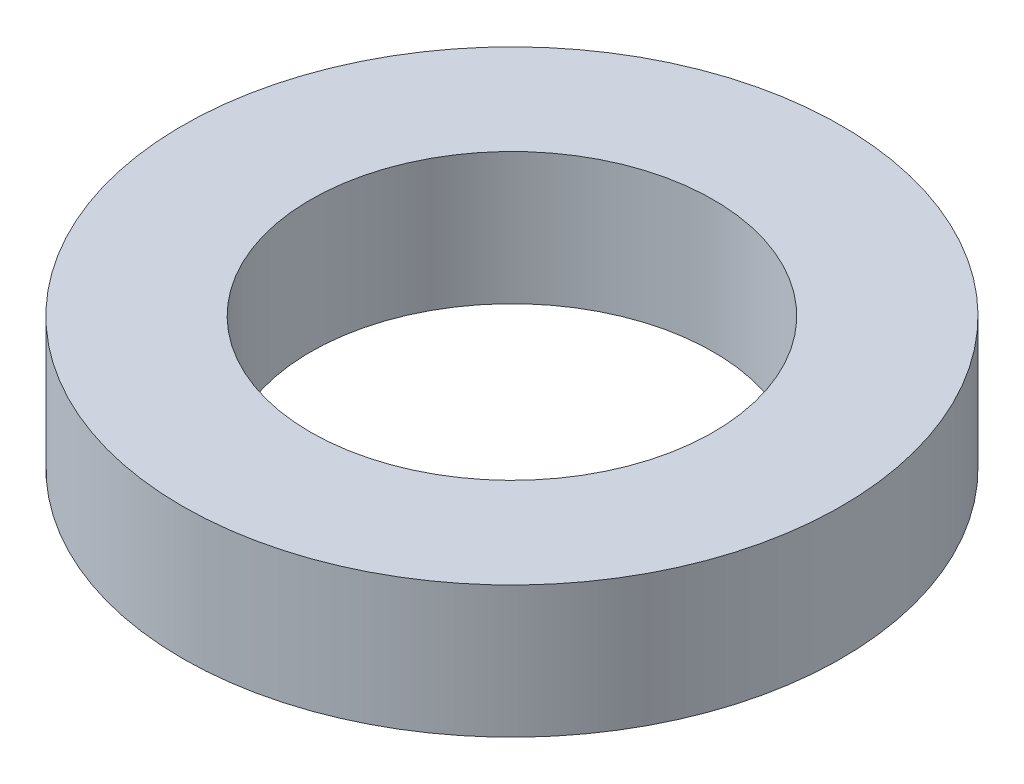
ISO-10303-21;
HEADER;
FILE_DESCRIPTION(('STEP AP214'),'2;1');
FILE_NAME('part.step','',(''),(''),'','','');
FILE_SCHEMA(('AUTOMOTIVE_DESIGN { 1 0 10303 214 1 1 1 1 }'));
ENDSEC;
DATA;
#1=APPLICATION_CONTEXT('core data for automotive mechanical design processes');
#2=APPLICATION_PROTOCOL_DEFINITION('international standard','automotive_design',2000,#1);
#3=PRODUCT_CONTEXT('',#1,'mechanical');
#4=PRODUCT('Part','Part','',(#3));
#5=PRODUCT_RELATED_PRODUCT_CATEGORY('part','',(#4));
#6=PRODUCT_DEFINITION_FORMATION('','',#4);
#7=PRODUCT_DEFINITION_CONTEXT('part definition',#1,'design');
#8=PRODUCT_DEFINITION('design','',#6,#7);
#9=PRODUCT_DEFINITION_SHAPE('','',#8);
#10=(LENGTH_UNIT() NAMED_UNIT(*) SI_UNIT(.MILLI.,.METRE.));
#11=(NAMED_UNIT(*) PLANE_ANGLE_UNIT() SI_UNIT($,.RADIAN.));
#12=(NAMED_UNIT(*) SI_UNIT($,.STERADIAN.) SOLID_ANGLE_UNIT());
#13=UNCERTAINTY_MEASURE_WITH_UNIT(LENGTH_MEASURE(1.E-05),#10,'distance_accuracy_value','');
#14=(GEOMETRIC_REPRESENTATION_CONTEXT(3) GLOBAL_UNCERTAINTY_ASSIGNED_CONTEXT((#13)) GLOBAL_UNIT_ASSIGNED_CONTEXT((#10,
#11,#12)) REPRESENTATION_CONTEXT('',''));
#15=CARTESIAN_POINT('',(0.,0.,0.));
#16=DIRECTION('',(0.,0.,1.));
#17=DIRECTION('',(1.,0.,0.));
#18=AXIS2_PLACEMENT_3D('',#15,#16,#17);
#19=CARTESIAN_POINT('',(0.,18.,0.));
#20=DIRECTION('',(0.,1.,0.));
#21=DIRECTION('',(0.,0.,1.));
#22=AXIS2_PLACEMENT_3D('',#19,#20,#21);
#23=PLANE('',#22);
#24=CARTESIAN_POINT('',(0.,18.,0.));
#25=DIRECTION('',(0.,1.,0.));
#26=DIRECTION('',(0.,0.,1.));
#27=AXIS2_PLACEMENT_3D('',#24,#25,#26);
#28=CIRCLE('',#27,45.);
#29=CARTESIAN_POINT('',(0.,18.,45.));
#30=VERTEX_POINT('',#29);
#31=EDGE_CURVE('E10',#30,#30,#28,.T.);
#32=ORIENTED_EDGE('',*,*,#31,.T.);
#33=EDGE_LOOP('',(#32));
#34=FACE_BOUND('',#33,.T.);
#35=CARTESIAN_POINT('',(0.,18.,0.));
#36=DIRECTION('',(0.,1.,0.));
#37=DIRECTION('',(0.,0.,1.));
#38=AXIS2_PLACEMENT_3D('',#35,#36,#37);
#39=CIRCLE('',#38,27.5);
#40=CARTESIAN_POINT('',(0.,18.,27.5));
#41=VERTEX_POINT('',#40);
#42=EDGE_CURVE('E48',#41,#41,#39,.T.);
#43=ORIENTED_EDGE('',*,*,#42,.F.);
#44=EDGE_LOOP('',(#43));
#45=FACE_BOUND('',#44,.T.);
#46=ADVANCED_FACE('F37',(#34,#45),#23,.T.);
#47=CARTESIAN_POINT('',(0.,0.,0.));
#48=DIRECTION('',(0.,1.,0.));
#49=DIRECTION('',(0.,0.,1.));
#50=AXIS2_PLACEMENT_3D('',#47,#48,#49);
#51=PLANE('',#50);
#52=CARTESIAN_POINT('',(0.,0.,0.));
#53=DIRECTION('',(0.,1.,0.));
#54=DIRECTION('',(0.,0.,1.));
#55=AXIS2_PLACEMENT_3D('',#52,#53,#54);
#56=CIRCLE('',#55,45.);
#57=CARTESIAN_POINT('',(0.,0.,45.));
#58=VERTEX_POINT('',#57);
#59=EDGE_CURVE('E41',#58,#58,#56,.T.);
#60=ORIENTED_EDGE('',*,*,#59,.F.);
#61=EDGE_LOOP('',(#60));
#62=FACE_BOUND('',#61,.T.);
#63=CARTESIAN_POINT('',(0.,0.,0.));
#64=DIRECTION('',(0.,1.,0.));
#65=DIRECTION('',(0.,0.,1.));
#66=AXIS2_PLACEMENT_3D('',#63,#64,#65);
#67=CIRCLE('',#66,27.5);
#68=CARTESIAN_POINT('',(0.,0.,27.5));
#69=VERTEX_POINT('',#68);
#70=EDGE_CURVE('E50',#69,#69,#67,.T.);
#71=ORIENTED_EDGE('',*,*,#70,.T.);
#72=EDGE_LOOP('',(#71));
#73=FACE_BOUND('',#72,.T.);
#74=ADVANCED_FACE('F60',(#62,#73),#51,.F.);
#75=CARTESIAN_POINT('',(0.,18.,0.));
#76=DIRECTION('',(0.,-1.,0.));
#77=DIRECTION('',(0.,0.,-1.));
#78=AXIS2_PLACEMENT_3D('',#75,#76,#77);
#79=CYLINDRICAL_SURFACE('',#78,45.);
#80=ORIENTED_EDGE('',*,*,#31,.F.);
#81=EDGE_LOOP('',(#80));
#82=FACE_BOUND('',#81,.T.);
#83=ORIENTED_EDGE('',*,*,#59,.T.);
#84=EDGE_LOOP('',(#83));
#85=FACE_BOUND('',#84,.T.);
#86=ADVANCED_FACE('F39',(#82,#85),#79,.T.);
#87=CARTESIAN_POINT('',(0.,18.,0.));
#88=DIRECTION('',(0.,-1.,0.));
#89=DIRECTION('',(0.,0.,-1.));
#90=AXIS2_PLACEMENT_3D('',#87,#88,#89);
#91=CYLINDRICAL_SURFACE('',#90,27.5);
#92=ORIENTED_EDGE('',*,*,#42,.T.);
#93=EDGE_LOOP('',(#92));
#94=FACE_BOUND('',#93,.T.);
#95=ORIENTED_EDGE('',*,*,#70,.F.);
#96=EDGE_LOOP('',(#95));
#97=FACE_BOUND('',#96,.T.);
#98=ADVANCED_FACE('F56',(#94,#97),#91,.F.);
#99=CLOSED_SHELL('',(#46,#74,#86,#98));
#100=MANIFOLD_SOLID_BREP('B2',#99);
#101=ADVANCED_BREP_SHAPE_REPRESENTATION('',(#18,#100),#14);
#102=SHAPE_DEFINITION_REPRESENTATION(#9,#101);
ENDSEC;
END-ISO-10303-21;
